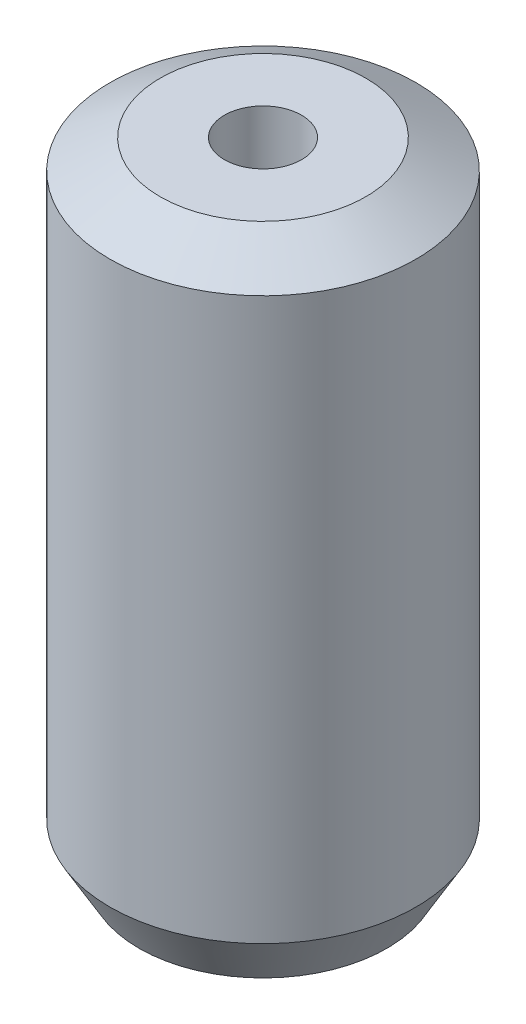
ISO-10303-21;
HEADER;
FILE_DESCRIPTION(('STEP AP214'),'2;1');
FILE_NAME('part.step','',(''),(''),'','','');
FILE_SCHEMA(('AUTOMOTIVE_DESIGN { 1 0 10303 214 1 1 1 1 }'));
ENDSEC;
DATA;
#1=APPLICATION_CONTEXT('core data for automotive mechanical design processes');
#2=APPLICATION_PROTOCOL_DEFINITION('international standard','automotive_design',2000,#1);
#3=PRODUCT_CONTEXT('',#1,'mechanical');
#4=PRODUCT('Part','Part','',(#3));
#5=PRODUCT_RELATED_PRODUCT_CATEGORY('part','',(#4));
#6=PRODUCT_DEFINITION_FORMATION('','',#4);
#7=PRODUCT_DEFINITION_CONTEXT('part definition',#1,'design');
#8=PRODUCT_DEFINITION('design','',#6,#7);
#9=PRODUCT_DEFINITION_SHAPE('','',#8);
#10=(LENGTH_UNIT() NAMED_UNIT(*) SI_UNIT(.MILLI.,.METRE.));
#11=(NAMED_UNIT(*) PLANE_ANGLE_UNIT() SI_UNIT($,.RADIAN.));
#12=(NAMED_UNIT(*) SI_UNIT($,.STERADIAN.) SOLID_ANGLE_UNIT());
#13=UNCERTAINTY_MEASURE_WITH_UNIT(LENGTH_MEASURE(1.E-05),#10,'distance_accuracy_value','');
#14=(GEOMETRIC_REPRESENTATION_CONTEXT(3) GLOBAL_UNCERTAINTY_ASSIGNED_CONTEXT((#13)) GLOBAL_UNIT_ASSIGNED_CONTEXT((#10,
#11,#12)) REPRESENTATION_CONTEXT('',''));
#15=CARTESIAN_POINT('',(0.,0.,0.));
#16=DIRECTION('',(0.,0.,1.));
#17=DIRECTION('',(1.,0.,0.));
#18=AXIS2_PLACEMENT_3D('',#15,#16,#17);
#19=CARTESIAN_POINT('',(0.,41.8460996495415,0.));
#20=DIRECTION('',(0.,-1.,0.));
#21=DIRECTION('',(0.,0.,-1.));
#22=AXIS2_PLACEMENT_3D('',#19,#20,#21);
#23=CYLINDRICAL_SURFACE('',#22,10.);
#24=CARTESIAN_POINT('',(0.,39.9520287403302,0.));
#25=DIRECTION('',(0.,1.,0.));
#26=DIRECTION('',(0.,0.,1.));
#27=AXIS2_PLACEMENT_3D('',#24,#25,#26);
#28=CIRCLE('',#27,10.);
#29=CARTESIAN_POINT('',(0.,39.9520287403302,10.));
#30=VERTEX_POINT('',#29);
#31=EDGE_CURVE('E50',#30,#30,#28,.F.);
#32=ORIENTED_EDGE('',*,*,#31,.T.);
#33=EDGE_LOOP('',(#32));
#34=FACE_BOUND('',#33,.T.);
#35=CARTESIAN_POINT('',(0.,3.28062704789214,0.));
#36=DIRECTION('',(0.,1.,0.));
#37=DIRECTION('',(0.,0.,1.));
#38=AXIS2_PLACEMENT_3D('',#35,#36,#37);
#39=CIRCLE('',#38,10.);
#40=CARTESIAN_POINT('',(0.,3.28062704789214,10.));
#41=VERTEX_POINT('',#40);
#42=EDGE_CURVE('E51',#41,#41,#39,.T.);
#43=ORIENTED_EDGE('',*,*,#42,.T.);
#44=EDGE_LOOP('',(#43));
#45=FACE_BOUND('',#44,.T.);
#46=ADVANCED_FACE('F39',(#34,#45),#23,.T.);
#47=CARTESIAN_POINT('',(0.,41.8460996495415,0.));
#48=DIRECTION('',(0.,1.,0.));
#49=DIRECTION('',(0.,0.,1.));
#50=AXIS2_PLACEMENT_3D('',#47,#48,#49);
#51=PLANE('',#50);
#52=CARTESIAN_POINT('',(0.,41.8460996495415,0.));
#53=DIRECTION('',(0.,1.,0.));
#54=DIRECTION('',(0.,0.,1.));
#55=AXIS2_PLACEMENT_3D('',#52,#53,#54);
#56=CIRCLE('',#55,6.71937295210788);
#57=CARTESIAN_POINT('',(0.,41.8460996495415,6.71937295210788));
#58=VERTEX_POINT('',#57);
#59=EDGE_CURVE('E54',#58,#58,#56,.T.);
#60=ORIENTED_EDGE('',*,*,#59,.T.);
#61=EDGE_LOOP('',(#60));
#62=FACE_BOUND('',#61,.T.);
#63=CARTESIAN_POINT('',(0.,41.8460996495415,0.));
#64=DIRECTION('',(0.,1.,0.));
#65=DIRECTION('',(0.,0.,1.));
#66=AXIS2_PLACEMENT_3D('',#63,#64,#65);
#67=CIRCLE('',#66,2.52307310476617);
#68=CARTESIAN_POINT('',(0.,41.8460996495415,2.52307310476617));
#69=VERTEX_POINT('',#68);
#70=EDGE_CURVE('E58',#69,#69,#67,.T.);
#71=ORIENTED_EDGE('',*,*,#70,.F.);
#72=EDGE_LOOP('',(#71));
#73=FACE_BOUND('',#72,.T.);
#74=ADVANCED_FACE('F69',(#62,#73),#51,.T.);
#75=CARTESIAN_POINT('',(0.,0.,0.));
#76=DIRECTION('',(0.,1.,0.));
#77=DIRECTION('',(0.,0.,1.));
#78=AXIS2_PLACEMENT_3D('',#75,#76,#77);
#79=PLANE('',#78);
#80=CARTESIAN_POINT('',(0.,0.,0.));
#81=DIRECTION('',(0.,1.,0.));
#82=DIRECTION('',(0.,0.,1.));
#83=AXIS2_PLACEMENT_3D('',#80,#81,#82);
#84=CIRCLE('',#83,8.10592909078869);
#85=CARTESIAN_POINT('',(0.,0.,8.10592909078869));
#86=VERTEX_POINT('',#85);
#87=EDGE_CURVE('E10',#86,#86,#84,.F.);
#88=ORIENTED_EDGE('',*,*,#87,.T.);
#89=EDGE_LOOP('',(#88));
#90=FACE_BOUND('',#89,.T.);
#91=CARTESIAN_POINT('',(0.,0.,0.));
#92=DIRECTION('',(0.,1.,0.));
#93=DIRECTION('',(0.,0.,1.));
#94=AXIS2_PLACEMENT_3D('',#91,#92,#93);
#95=CIRCLE('',#94,2.52307310476617);
#96=CARTESIAN_POINT('',(0.,0.,2.52307310476617));
#97=VERTEX_POINT('',#96);
#98=EDGE_CURVE('E63',#97,#97,#95,.T.);
#99=ORIENTED_EDGE('',*,*,#98,.T.);
#100=EDGE_LOOP('',(#99));
#101=FACE_BOUND('',#100,.T.);
#102=ADVANCED_FACE('F75',(#90,#101),#79,.F.);
#103=CARTESIAN_POINT('',(0.,41.8460996495415,0.));
#104=DIRECTION('',(0.,-1.,0.));
#105=DIRECTION('',(0.,0.,-1.));
#106=AXIS2_PLACEMENT_3D('',#103,#104,#105);
#107=CYLINDRICAL_SURFACE('',#106,2.52307310476617);
#108=ORIENTED_EDGE('',*,*,#70,.T.);
#109=EDGE_LOOP('',(#108));
#110=FACE_BOUND('',#109,.T.);
#111=ORIENTED_EDGE('',*,*,#98,.F.);
#112=EDGE_LOOP('',(#111));
#113=FACE_BOUND('',#112,.T.);
#114=ADVANCED_FACE('F70',(#110,#113),#107,.F.);
#115=CARTESIAN_POINT('',(0.,41.8460996495415,0.));
#116=DIRECTION('',(0.,-1.,0.));
#117=DIRECTION('',(0.,0.,-1.));
#118=AXIS2_PLACEMENT_3D('',#115,#116,#117);
#119=CONICAL_SURFACE('',#118,6.71937295210788,1.04719755119659);
#120=ORIENTED_EDGE('',*,*,#31,.F.);
#121=EDGE_LOOP('',(#120));
#122=FACE_BOUND('',#121,.T.);
#123=ORIENTED_EDGE('',*,*,#59,.F.);
#124=EDGE_LOOP('',(#123));
#125=FACE_BOUND('',#124,.T.);
#126=ADVANCED_FACE('F81',(#122,#125),#119,.T.);
#127=CARTESIAN_POINT('',(0.,3.28062704789214,0.));
#128=DIRECTION('',(0.,1.,0.));
#129=DIRECTION('',(0.,0.,1.));
#130=AXIS2_PLACEMENT_3D('',#127,#128,#129);
#131=CONICAL_SURFACE('',#130,10.,0.523598775598303);
#132=CARTESIAN_POINT('',(0.,0.,8.10592909078869));
#133=CARTESIAN_POINT('',(0.,0.0341731984155426,8.12565899609297));
#134=CARTESIAN_POINT('',(0.,0.0683463968310858,8.14538890139726));
#135=CARTESIAN_POINT('',(0.,0.136692793662172,8.18484871200583));
#136=CARTESIAN_POINT('',(0.,0.170865992077715,8.20457861731011));
#137=CARTESIAN_POINT('',(0.,0.239212388908801,8.24403842791868));
#138=CARTESIAN_POINT('',(0.,0.273385587324344,8.26376833322297));
#139=CARTESIAN_POINT('',(0.,0.34173198415543,8.30322814383153));
#140=CARTESIAN_POINT('',(0.,0.375905182570974,8.32295804913582));
#141=CARTESIAN_POINT('',(0.,0.44425157940206,8.36241785974439));
#142=CARTESIAN_POINT('',(0.,0.478424777817603,8.38214776504867));
#143=CARTESIAN_POINT('',(0.,0.546771174648689,8.42160757565724));
#144=CARTESIAN_POINT('',(0.,0.580944373064232,8.44133748096153));
#145=CARTESIAN_POINT('',(0.,0.649290769895319,8.4807972915701));
#146=CARTESIAN_POINT('',(0.,0.683463968310861,8.50052719687438));
#147=CARTESIAN_POINT('',(0.,0.751810365141947,8.53998700748295));
#148=CARTESIAN_POINT('',(0.,0.78598356355749,8.55971691278723));
#149=CARTESIAN_POINT('',(0.,0.854329960388577,8.5991767233958));
#150=CARTESIAN_POINT('',(0.,0.88850315880412,8.61890662870009));
#151=CARTESIAN_POINT('',(0.,0.956849555635206,8.65836643930865));
#152=CARTESIAN_POINT('',(0.,0.991022754050749,8.67809634461294));
#153=CARTESIAN_POINT('',(0.,1.05936915088184,8.71755615522151));
#154=CARTESIAN_POINT('',(0.,1.09354234929738,8.73728606052579));
#155=CARTESIAN_POINT('',(0.,1.16188874612846,8.77674587113436));
#156=CARTESIAN_POINT('',(0.,1.19606194454401,8.79647577643865));
#157=CARTESIAN_POINT('',(0.,1.26440834137509,8.83593558704722));
#158=CARTESIAN_POINT('',(0.,1.29858153979064,8.8556654923515));
#159=CARTESIAN_POINT('',(0.,1.36692793662172,8.89512530296007));
#160=CARTESIAN_POINT('',(0.,1.40110113503727,8.91485520826435));
#161=CARTESIAN_POINT('',(0.,1.46944753186835,8.95431501887292));
#162=CARTESIAN_POINT('',(0.,1.5036207302839,8.97404492417721));
#163=CARTESIAN_POINT('',(0.,1.57196712711498,9.01350473478578));
#164=CARTESIAN_POINT('',(0.,1.60614032553052,9.03323464009006));
#165=CARTESIAN_POINT('',(0.,1.67448672236161,9.07269445069863));
#166=CARTESIAN_POINT('',(0.,1.70865992077715,9.09242435600292));
#167=CARTESIAN_POINT('',(0.,1.77700631760824,9.13188416661148));
#168=CARTESIAN_POINT('',(0.,1.81117951602378,9.15161407191577));
#169=CARTESIAN_POINT('',(0.,1.87952591285487,9.19107388252434));
#170=CARTESIAN_POINT('',(0.,1.91369911127041,9.21080378782862));
#171=CARTESIAN_POINT('',(0.,1.9820455081015,9.25026359843719));
#172=CARTESIAN_POINT('',(0.,2.01621870651704,9.26999350374147));
#173=CARTESIAN_POINT('',(0.,2.08456510334813,9.30945331435004));
#174=CARTESIAN_POINT('',(0.,2.11873830176367,9.32918321965433));
#175=CARTESIAN_POINT('',(0.,2.18708469859476,9.36864303026289));
#176=CARTESIAN_POINT('',(0.,2.2212578970103,9.38837293556718));
#177=CARTESIAN_POINT('',(0.,2.28960429384139,9.42783274617575));
#178=CARTESIAN_POINT('',(0.,2.32377749225693,9.44756265148003));
#179=CARTESIAN_POINT('',(0.,2.39212388908802,9.4870224620886));
#180=CARTESIAN_POINT('',(0.,2.42629708750356,9.50675236739289));
#181=CARTESIAN_POINT('',(0.,2.49464348433464,9.54621217800146));
#182=CARTESIAN_POINT('',(0.,2.52881668275019,9.56594208330574));
#183=CARTESIAN_POINT('',(0.,2.59716307958127,9.60540189391431));
#184=CARTESIAN_POINT('',(0.,2.63133627799682,9.6251317992186));
#185=CARTESIAN_POINT('',(0.,2.6996826748279,9.66459160982716));
#186=CARTESIAN_POINT('',(0.,2.73385587324345,9.68432151513145));
#187=CARTESIAN_POINT('',(0.,2.80220227007453,9.72378132574002));
#188=CARTESIAN_POINT('',(0.,2.83637546849008,9.7435112310443));
#189=CARTESIAN_POINT('',(0.,2.90472186532116,9.78297104165287));
#190=CARTESIAN_POINT('',(0.,2.9388950637367,9.80270094695716));
#191=CARTESIAN_POINT('',(0.,3.00724146056779,9.84216075756572));
#192=CARTESIAN_POINT('',(0.,3.04141465898333,9.86189066287001));
#193=CARTESIAN_POINT('',(0.,3.10976105581442,9.90135047347858));
#194=CARTESIAN_POINT('',(0.,3.14393425422996,9.92108037878286));
#195=CARTESIAN_POINT('',(0.,3.21228065106105,9.96054018939143));
#196=CARTESIAN_POINT('',(0.,3.24645384947659,9.98027009469572));
#197=CARTESIAN_POINT('',(0.,3.28062704789214,10.));
#198=B_SPLINE_CURVE_WITH_KNOTS('',3,(#132,#133,#134,#135,#136,#137,#138,#139,#140,#141,#142,
#143,#144,#145,#146,#147,#148,#149,#150,#151,#152,#153,#154,#155,#156,#157,#158,#159,#160,#161,
#162,#163,#164,#165,#166,#167,#168,#169,#170,#171,#172,#173,#174,#175,#176,#177,#178,#179,#180,
#181,#182,#183,#184,#185,#186,#187,#188,#189,#190,#191,#192,#193,#194,#195,#196,#197),
.UNSPECIFIED.,.F.,.F.,(4,2,2,2,2,2,2,2,2,2,2,2,2,2,2,2,2,2,2,2,2,2,2,2,2,2,2,2,2,2,2,2,4),(0.,
0.118379431825706,0.236758863651411,0.355138295477118,0.473517727302824,0.59189715912853,
0.710276590954236,0.828656022779943,0.947035454605648,1.06541488643135,1.18379431825706,
1.30217375008277,1.42055318190847,1.53893261373418,1.65731204555988,1.77569147738559,
1.8940709092113,2.012450341037,2.13082977286271,2.24920920468841,2.36758863651412,
2.48596806833983,2.60434750016553,2.72272693199124,2.84110636381695,2.95948579564265,
3.07786522746836,3.19624465929406,3.31462409111977,3.43300352294548,3.55138295477118,
3.66976238659689,3.78814181842259),.UNSPECIFIED.);
#199=EDGE_CURVE('BSEAM45',#86,#41,#198,.T.);
#200=ORIENTED_EDGE('',*,*,#87,.F.);
#201=ORIENTED_EDGE('',*,*,#42,.F.);
#202=ORIENTED_EDGE('',*,*,#199,.T.);
#203=ORIENTED_EDGE('',*,*,#199,.F.);
#204=EDGE_LOOP('',(#200,#202,#201,#203));
#205=FACE_BOUND('',#204,.T.);
#206=ADVANCED_FACE('F45',(#205),#131,.T.);
#207=CLOSED_SHELL('',(#46,#74,#102,#114,#126,#206));
#208=MANIFOLD_SOLID_BREP('B2',#207);
#209=ADVANCED_BREP_SHAPE_REPRESENTATION('',(#18,#208),#14);
#210=SHAPE_DEFINITION_REPRESENTATION(#9,#209);
ENDSEC;
END-ISO-10303-21;
